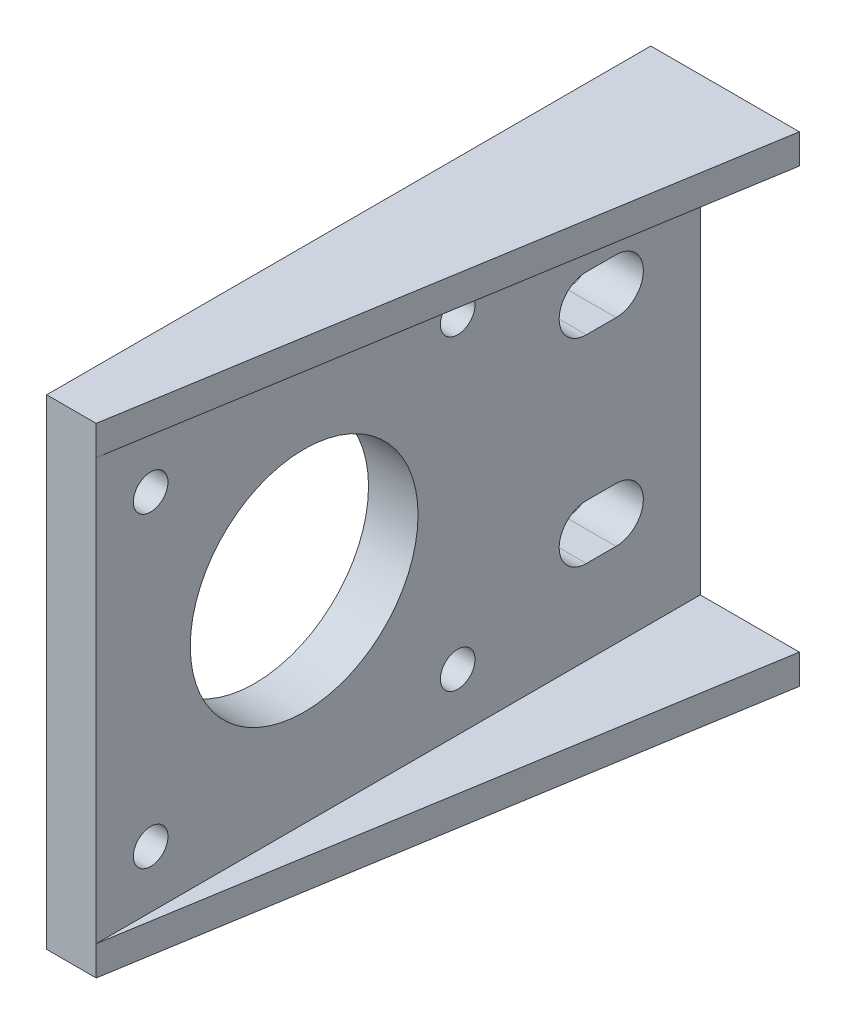
ISO-10303-21;
HEADER;
FILE_DESCRIPTION(('STEP AP214'),'2;1');
FILE_NAME('part.step','',(''),(''),'','','');
FILE_SCHEMA(('AUTOMOTIVE_DESIGN { 1 0 10303 214 1 1 1 1 }'));
ENDSEC;
DATA;
#1=APPLICATION_CONTEXT('core data for automotive mechanical design processes');
#2=APPLICATION_PROTOCOL_DEFINITION('international standard','automotive_design',2000,#1);
#3=PRODUCT_CONTEXT('',#1,'mechanical');
#4=PRODUCT('Part','Part','',(#3));
#5=PRODUCT_RELATED_PRODUCT_CATEGORY('part','',(#4));
#6=PRODUCT_DEFINITION_FORMATION('','',#4);
#7=PRODUCT_DEFINITION_CONTEXT('part definition',#1,'design');
#8=PRODUCT_DEFINITION('design','',#6,#7);
#9=PRODUCT_DEFINITION_SHAPE('','',#8);
#10=(LENGTH_UNIT() NAMED_UNIT(*) SI_UNIT(.MILLI.,.METRE.));
#11=(NAMED_UNIT(*) PLANE_ANGLE_UNIT() SI_UNIT($,.RADIAN.));
#12=(NAMED_UNIT(*) SI_UNIT($,.STERADIAN.) SOLID_ANGLE_UNIT());
#13=UNCERTAINTY_MEASURE_WITH_UNIT(LENGTH_MEASURE(1.E-05),#10,'distance_accuracy_value','');
#14=(GEOMETRIC_REPRESENTATION_CONTEXT(3) GLOBAL_UNCERTAINTY_ASSIGNED_CONTEXT((#13)) GLOBAL_UNIT_ASSIGNED_CONTEXT((#10,
#11,#12)) REPRESENTATION_CONTEXT('',''));
#15=CARTESIAN_POINT('',(0.,0.,0.));
#16=DIRECTION('',(0.,0.,1.));
#17=DIRECTION('',(1.,0.,0.));
#18=AXIS2_PLACEMENT_3D('',#15,#16,#17);
#19=CARTESIAN_POINT('',(5.,0.,0.));
#20=DIRECTION('',(-1.,0.,0.));
#21=DIRECTION('',(0.,0.,1.));
#22=AXIS2_PLACEMENT_3D('',#19,#20,#21);
#23=PLANE('',#22);
#24=CARTESIAN_POINT('',(5.,10.,-28.5));
#25=DIRECTION('',(1.,0.,0.));
#26=DIRECTION('',(0.,0.,-1.));
#27=AXIS2_PLACEMENT_3D('',#24,#25,#26);
#28=CIRCLE('',#27,2.75);
#29=CARTESIAN_POINT('',(5.,12.75,-28.5));
#30=VERTEX_POINT('',#29);
#31=CARTESIAN_POINT('',(5.,7.25,-28.5));
#32=VERTEX_POINT('',#31);
#33=EDGE_CURVE('E225',#30,#32,#28,.T.);
#34=ORIENTED_EDGE('',*,*,#33,.F.);
#35=DIRECTION('',(0.,0.,1.));
#36=VECTOR('',#35,1.);
#37=CARTESIAN_POINT('',(5.,12.75,-28.5));
#38=LINE('',#37,#36);
#39=CARTESIAN_POINT('',(5.,12.75,-31.5));
#40=VERTEX_POINT('',#39);
#41=EDGE_CURVE('E233',#40,#30,#38,.T.);
#42=ORIENTED_EDGE('',*,*,#41,.F.);
#43=CARTESIAN_POINT('',(5.,10.,-31.5));
#44=DIRECTION('',(1.,0.,0.));
#45=DIRECTION('',(0.,0.,-1.));
#46=AXIS2_PLACEMENT_3D('',#43,#44,#45);
#47=CIRCLE('',#46,2.75);
#48=CARTESIAN_POINT('',(5.,7.25,-31.5));
#49=VERTEX_POINT('',#48);
#50=EDGE_CURVE('E230',#49,#40,#47,.T.);
#51=ORIENTED_EDGE('',*,*,#50,.F.);
#52=DIRECTION('',(0.,0.,-1.));
#53=VECTOR('',#52,1.);
#54=CARTESIAN_POINT('',(5.,7.25,-28.5));
#55=LINE('',#54,#53);
#56=EDGE_CURVE('E227',#32,#49,#55,.T.);
#57=ORIENTED_EDGE('',*,*,#56,.F.);
#58=EDGE_LOOP('',(#34,#42,#51,#57));
#59=FACE_BOUND('',#58,.T.);
#60=DIRECTION('',(0.,1.,0.));
#61=VECTOR('',#60,1.);
#62=CARTESIAN_POINT('',(5.,-21.25,-40.));
#63=LINE('',#62,#61);
#64=CARTESIAN_POINT('',(5.,-21.25,-40.));
#65=VERTEX_POINT('',#64);
#66=CARTESIAN_POINT('',(5.,21.25,-40.));
#67=VERTEX_POINT('',#66);
#68=EDGE_CURVE('E286',#65,#67,#63,.T.);
#69=ORIENTED_EDGE('',*,*,#68,.T.);
#70=DIRECTION('',(0.,0.,1.));
#71=VECTOR('',#70,1.);
#72=CARTESIAN_POINT('',(5.,21.25,21.));
#73=LINE('',#72,#71);
#74=CARTESIAN_POINT('',(5.,21.25,21.));
#75=VERTEX_POINT('',#74);
#76=EDGE_CURVE('E151',#67,#75,#73,.T.);
#77=ORIENTED_EDGE('',*,*,#76,.T.);
#78=DIRECTION('',(0.,-1.,0.));
#79=VECTOR('',#78,1.);
#80=CARTESIAN_POINT('',(5.,-21.25,21.));
#81=LINE('',#80,#79);
#82=CARTESIAN_POINT('',(5.,-21.25,21.));
#83=VERTEX_POINT('',#82);
#84=EDGE_CURVE('E43',#75,#83,#81,.T.);
#85=ORIENTED_EDGE('',*,*,#84,.T.);
#86=DIRECTION('',(0.,0.,-1.));
#87=VECTOR('',#86,1.);
#88=CARTESIAN_POINT('',(5.,-21.25,21.));
#89=LINE('',#88,#87);
#90=EDGE_CURVE('E11',#83,#65,#89,.T.);
#91=ORIENTED_EDGE('',*,*,#90,.T.);
#92=EDGE_LOOP('',(#69,#77,#85,#91));
#93=FACE_BOUND('',#92,.T.);
#94=CARTESIAN_POINT('',(5.,0.,0.));
#95=DIRECTION('',(1.,0.,0.));
#96=DIRECTION('',(0.,0.,-1.));
#97=AXIS2_PLACEMENT_3D('',#94,#95,#96);
#98=CIRCLE('',#97,11.5);
#99=CARTESIAN_POINT('',(5.,0.,-11.5));
#100=VERTEX_POINT('',#99);
#101=EDGE_CURVE('E280',#100,#100,#98,.T.);
#102=ORIENTED_EDGE('',*,*,#101,.F.);
#103=EDGE_LOOP('',(#102));
#104=FACE_BOUND('',#103,.T.);
#105=CARTESIAN_POINT('',(5.,15.5,15.5));
#106=DIRECTION('',(1.,0.,0.));
#107=DIRECTION('',(0.,0.,-1.));
#108=AXIS2_PLACEMENT_3D('',#105,#106,#107);
#109=CIRCLE('',#108,1.75);
#110=CARTESIAN_POINT('',(5.,15.5,13.75));
#111=VERTEX_POINT('',#110);
#112=EDGE_CURVE('E274',#111,#111,#109,.T.);
#113=ORIENTED_EDGE('',*,*,#112,.F.);
#114=EDGE_LOOP('',(#113));
#115=FACE_BOUND('',#114,.T.);
#116=CARTESIAN_POINT('',(5.,-15.5,-15.5));
#117=DIRECTION('',(1.,0.,0.));
#118=DIRECTION('',(0.,0.,-1.));
#119=AXIS2_PLACEMENT_3D('',#116,#117,#118);
#120=CIRCLE('',#119,1.75);
#121=CARTESIAN_POINT('',(5.,-15.5,-17.25));
#122=VERTEX_POINT('',#121);
#123=EDGE_CURVE('E268',#122,#122,#120,.T.);
#124=ORIENTED_EDGE('',*,*,#123,.F.);
#125=EDGE_LOOP('',(#124));
#126=FACE_BOUND('',#125,.T.);
#127=CARTESIAN_POINT('',(5.,15.5,-15.5));
#128=DIRECTION('',(1.,0.,0.));
#129=DIRECTION('',(0.,0.,1.));
#130=AXIS2_PLACEMENT_3D('',#127,#128,#129);
#131=CIRCLE('',#130,1.74999999999999);
#132=CARTESIAN_POINT('',(5.,15.5,-13.75));
#133=VERTEX_POINT('',#132);
#134=EDGE_CURVE('E262',#133,#133,#131,.T.);
#135=ORIENTED_EDGE('',*,*,#134,.F.);
#136=EDGE_LOOP('',(#135));
#137=FACE_BOUND('',#136,.T.);
#138=CARTESIAN_POINT('',(5.,-15.5,15.5));
#139=DIRECTION('',(1.,0.,0.));
#140=DIRECTION('',(0.,0.,1.));
#141=AXIS2_PLACEMENT_3D('',#138,#139,#140);
#142=CIRCLE('',#141,1.75);
#143=CARTESIAN_POINT('',(5.,-15.5,17.25));
#144=VERTEX_POINT('',#143);
#145=EDGE_CURVE('E256',#144,#144,#142,.T.);
#146=ORIENTED_EDGE('',*,*,#145,.F.);
#147=EDGE_LOOP('',(#146));
#148=FACE_BOUND('',#147,.T.);
#149=CARTESIAN_POINT('',(5.,-9.99999999999999,-28.5));
#150=DIRECTION('',(1.,0.,0.));
#151=DIRECTION('',(0.,0.,1.));
#152=AXIS2_PLACEMENT_3D('',#149,#150,#151);
#153=CIRCLE('',#152,2.75);
#154=CARTESIAN_POINT('',(5.,-7.25,-28.5));
#155=VERTEX_POINT('',#154);
#156=CARTESIAN_POINT('',(5.,-12.75,-28.5));
#157=VERTEX_POINT('',#156);
#158=EDGE_CURVE('E199',#155,#157,#153,.T.);
#159=ORIENTED_EDGE('',*,*,#158,.F.);
#160=DIRECTION('',(0.,0.,1.));
#161=VECTOR('',#160,1.);
#162=CARTESIAN_POINT('',(5.,-7.25,-28.5));
#163=LINE('',#162,#161);
#164=CARTESIAN_POINT('',(5.,-7.25,-31.5));
#165=VERTEX_POINT('',#164);
#166=EDGE_CURVE('E206',#165,#155,#163,.T.);
#167=ORIENTED_EDGE('',*,*,#166,.F.);
#168=CARTESIAN_POINT('',(5.,-9.99999999999999,-31.5));
#169=DIRECTION('',(1.,0.,0.));
#170=DIRECTION('',(0.,0.,1.));
#171=AXIS2_PLACEMENT_3D('',#168,#169,#170);
#172=CIRCLE('',#171,2.75);
#173=CARTESIAN_POINT('',(5.,-12.75,-31.5));
#174=VERTEX_POINT('',#173);
#175=EDGE_CURVE('E204',#174,#165,#172,.T.);
#176=ORIENTED_EDGE('',*,*,#175,.F.);
#177=DIRECTION('',(0.,0.,-1.));
#178=VECTOR('',#177,1.);
#179=CARTESIAN_POINT('',(5.,-12.75,-28.5));
#180=LINE('',#179,#178);
#181=EDGE_CURVE('E201',#157,#174,#180,.T.);
#182=ORIENTED_EDGE('',*,*,#181,.F.);
#183=EDGE_LOOP('',(#159,#167,#176,#182));
#184=FACE_BOUND('',#183,.T.);
#185=ADVANCED_FACE('F34',(#59,#93,#104,#115,#126,#137,#148,#184),#23,.F.);
#186=CARTESIAN_POINT('',(0.,0.,0.));
#187=DIRECTION('',(-1.,0.,0.));
#188=DIRECTION('',(0.,0.,1.));
#189=AXIS2_PLACEMENT_3D('',#186,#187,#188);
#190=PLANE('',#189);
#191=CARTESIAN_POINT('',(0.,15.5,-15.5));
#192=DIRECTION('',(1.,0.,0.));
#193=DIRECTION('',(0.,0.,1.));
#194=AXIS2_PLACEMENT_3D('',#191,#192,#193);
#195=CIRCLE('',#194,1.74999999999999);
#196=CARTESIAN_POINT('',(0.,15.5,-13.75));
#197=VERTEX_POINT('',#196);
#198=EDGE_CURVE('E259',#197,#197,#195,.T.);
#199=ORIENTED_EDGE('',*,*,#198,.T.);
#200=EDGE_LOOP('',(#199));
#201=FACE_BOUND('',#200,.T.);
#202=CARTESIAN_POINT('',(0.,15.5,15.5));
#203=DIRECTION('',(1.,0.,0.));
#204=DIRECTION('',(0.,0.,-1.));
#205=AXIS2_PLACEMENT_3D('',#202,#203,#204);
#206=CIRCLE('',#205,1.75);
#207=CARTESIAN_POINT('',(0.,15.5,13.75));
#208=VERTEX_POINT('',#207);
#209=EDGE_CURVE('E271',#208,#208,#206,.T.);
#210=ORIENTED_EDGE('',*,*,#209,.T.);
#211=EDGE_LOOP('',(#210));
#212=FACE_BOUND('',#211,.T.);
#213=DIRECTION('',(0.,1.,0.));
#214=VECTOR('',#213,1.);
#215=CARTESIAN_POINT('',(0.,-21.25,-40.));
#216=LINE('',#215,#214);
#217=CARTESIAN_POINT('',(0.,-24.25,-40.));
#218=VERTEX_POINT('',#217);
#219=CARTESIAN_POINT('',(0.,24.25,-40.));
#220=VERTEX_POINT('',#219);
#221=EDGE_CURVE('E283',#218,#220,#216,.T.);
#222=ORIENTED_EDGE('',*,*,#221,.F.);
#223=DIRECTION('',(0.,0.,-1.));
#224=VECTOR('',#223,1.);
#225=CARTESIAN_POINT('',(0.,-24.25,21.));
#226=LINE('',#225,#224);
#227=CARTESIAN_POINT('',(0.,-24.25,21.));
#228=VERTEX_POINT('',#227);
#229=EDGE_CURVE('E179',#228,#218,#226,.T.);
#230=ORIENTED_EDGE('',*,*,#229,.F.);
#231=DIRECTION('',(0.,-1.,0.));
#232=VECTOR('',#231,1.);
#233=CARTESIAN_POINT('',(0.,-21.25,21.));
#234=LINE('',#233,#232);
#235=CARTESIAN_POINT('',(0.,24.25,21.));
#236=VERTEX_POINT('',#235);
#237=EDGE_CURVE('E38',#236,#228,#234,.T.);
#238=ORIENTED_EDGE('',*,*,#237,.F.);
#239=DIRECTION('',(0.,0.,-1.));
#240=VECTOR('',#239,1.);
#241=CARTESIAN_POINT('',(0.,24.25,21.));
#242=LINE('',#241,#240);
#243=EDGE_CURVE('E171',#236,#220,#242,.T.);
#244=ORIENTED_EDGE('',*,*,#243,.T.);
#245=EDGE_LOOP('',(#222,#230,#238,#244));
#246=FACE_BOUND('',#245,.T.);
#247=CARTESIAN_POINT('',(0.,0.,0.));
#248=DIRECTION('',(1.,0.,0.));
#249=DIRECTION('',(0.,0.,-1.));
#250=AXIS2_PLACEMENT_3D('',#247,#248,#249);
#251=CIRCLE('',#250,11.5);
#252=CARTESIAN_POINT('',(0.,0.,-11.5));
#253=VERTEX_POINT('',#252);
#254=EDGE_CURVE('E277',#253,#253,#251,.T.);
#255=ORIENTED_EDGE('',*,*,#254,.T.);
#256=EDGE_LOOP('',(#255));
#257=FACE_BOUND('',#256,.T.);
#258=CARTESIAN_POINT('',(0.,-15.5,-15.5));
#259=DIRECTION('',(1.,0.,0.));
#260=DIRECTION('',(0.,0.,-1.));
#261=AXIS2_PLACEMENT_3D('',#258,#259,#260);
#262=CIRCLE('',#261,1.75);
#263=CARTESIAN_POINT('',(0.,-15.5,-17.25));
#264=VERTEX_POINT('',#263);
#265=EDGE_CURVE('E265',#264,#264,#262,.T.);
#266=ORIENTED_EDGE('',*,*,#265,.T.);
#267=EDGE_LOOP('',(#266));
#268=FACE_BOUND('',#267,.T.);
#269=CARTESIAN_POINT('',(0.,-15.5,15.5));
#270=DIRECTION('',(1.,0.,0.));
#271=DIRECTION('',(0.,0.,1.));
#272=AXIS2_PLACEMENT_3D('',#269,#270,#271);
#273=CIRCLE('',#272,1.75);
#274=CARTESIAN_POINT('',(0.,-15.5,17.25));
#275=VERTEX_POINT('',#274);
#276=EDGE_CURVE('E255',#275,#275,#273,.T.);
#277=ORIENTED_EDGE('',*,*,#276,.T.);
#278=EDGE_LOOP('',(#277));
#279=FACE_BOUND('',#278,.T.);
#280=DIRECTION('',(0.,0.,1.));
#281=VECTOR('',#280,1.);
#282=CARTESIAN_POINT('',(0.,12.75,-28.5));
#283=LINE('',#282,#281);
#284=CARTESIAN_POINT('',(0.,12.75,-31.5));
#285=VERTEX_POINT('',#284);
#286=CARTESIAN_POINT('',(0.,12.75,-28.5));
#287=VERTEX_POINT('',#286);
#288=EDGE_CURVE('E228',#285,#287,#283,.T.);
#289=ORIENTED_EDGE('',*,*,#288,.T.);
#290=CARTESIAN_POINT('',(0.,10.,-28.5));
#291=DIRECTION('',(1.,0.,0.));
#292=DIRECTION('',(0.,0.,-1.));
#293=AXIS2_PLACEMENT_3D('',#290,#291,#292);
#294=CIRCLE('',#293,2.75);
#295=CARTESIAN_POINT('',(0.,7.25,-28.5));
#296=VERTEX_POINT('',#295);
#297=EDGE_CURVE('E224',#287,#296,#294,.T.);
#298=ORIENTED_EDGE('',*,*,#297,.T.);
#299=DIRECTION('',(0.,0.,-1.));
#300=VECTOR('',#299,1.);
#301=CARTESIAN_POINT('',(0.,7.25,-28.5));
#302=LINE('',#301,#300);
#303=CARTESIAN_POINT('',(0.,7.25,-31.5));
#304=VERTEX_POINT('',#303);
#305=EDGE_CURVE('E238',#296,#304,#302,.T.);
#306=ORIENTED_EDGE('',*,*,#305,.T.);
#307=CARTESIAN_POINT('',(0.,10.,-31.5));
#308=DIRECTION('',(1.,0.,0.));
#309=DIRECTION('',(0.,0.,-1.));
#310=AXIS2_PLACEMENT_3D('',#307,#308,#309);
#311=CIRCLE('',#310,2.75);
#312=EDGE_CURVE('E241',#304,#285,#311,.T.);
#313=ORIENTED_EDGE('',*,*,#312,.T.);
#314=EDGE_LOOP('',(#289,#298,#306,#313));
#315=FACE_BOUND('',#314,.T.);
#316=DIRECTION('',(0.,0.,1.));
#317=VECTOR('',#316,1.);
#318=CARTESIAN_POINT('',(0.,-7.25,-28.5));
#319=LINE('',#318,#317);
#320=CARTESIAN_POINT('',(0.,-7.24999999999999,-31.5));
#321=VERTEX_POINT('',#320);
#322=CARTESIAN_POINT('',(0.,-7.25,-28.5));
#323=VERTEX_POINT('',#322);
#324=EDGE_CURVE('E202',#321,#323,#319,.T.);
#325=ORIENTED_EDGE('',*,*,#324,.T.);
#326=CARTESIAN_POINT('',(0.,-9.99999999999999,-28.5));
#327=DIRECTION('',(1.,0.,0.));
#328=DIRECTION('',(0.,0.,1.));
#329=AXIS2_PLACEMENT_3D('',#326,#327,#328);
#330=CIRCLE('',#329,2.75);
#331=CARTESIAN_POINT('',(0.,-12.75,-28.5));
#332=VERTEX_POINT('',#331);
#333=EDGE_CURVE('E59',#323,#332,#330,.T.);
#334=ORIENTED_EDGE('',*,*,#333,.T.);
#335=DIRECTION('',(0.,0.,-1.));
#336=VECTOR('',#335,1.);
#337=CARTESIAN_POINT('',(0.,-12.75,-28.5));
#338=LINE('',#337,#336);
#339=CARTESIAN_POINT('',(0.,-12.75,-31.5));
#340=VERTEX_POINT('',#339);
#341=EDGE_CURVE('E210',#332,#340,#338,.T.);
#342=ORIENTED_EDGE('',*,*,#341,.T.);
#343=CARTESIAN_POINT('',(0.,-9.99999999999999,-31.5));
#344=DIRECTION('',(1.,0.,0.));
#345=DIRECTION('',(0.,0.,1.));
#346=AXIS2_PLACEMENT_3D('',#343,#344,#345);
#347=CIRCLE('',#346,2.75);
#348=EDGE_CURVE('E213',#340,#321,#347,.T.);
#349=ORIENTED_EDGE('',*,*,#348,.T.);
#350=EDGE_LOOP('',(#325,#334,#342,#349));
#351=FACE_BOUND('',#350,.T.);
#352=ADVANCED_FACE('F302',(#201,#212,#246,#257,#268,#279,#315,#351),#190,.T.);
#353=CARTESIAN_POINT('',(5.,-21.25,-40.));
#354=DIRECTION('',(0.,0.,1.));
#355=DIRECTION('',(1.,0.,0.));
#356=AXIS2_PLACEMENT_3D('',#353,#354,#355);
#357=PLANE('',#356);
#358=ORIENTED_EDGE('',*,*,#221,.T.);
#359=DIRECTION('',(1.,0.,0.));
#360=VECTOR('',#359,1.);
#361=CARTESIAN_POINT('',(0.,24.25,-40.));
#362=LINE('',#361,#360);
#363=CARTESIAN_POINT('',(15.,24.25,-40.));
#364=VERTEX_POINT('',#363);
#365=EDGE_CURVE('E160',#220,#364,#362,.T.);
#366=ORIENTED_EDGE('',*,*,#365,.T.);
#367=DIRECTION('',(0.,1.,0.));
#368=VECTOR('',#367,1.);
#369=CARTESIAN_POINT('',(15.,21.25,-40.));
#370=LINE('',#369,#368);
#371=CARTESIAN_POINT('',(15.,21.25,-40.));
#372=VERTEX_POINT('',#371);
#373=EDGE_CURVE('E158',#372,#364,#370,.T.);
#374=ORIENTED_EDGE('',*,*,#373,.F.);
#375=DIRECTION('',(1.,0.,0.));
#376=VECTOR('',#375,1.);
#377=CARTESIAN_POINT('',(0.,21.25,-40.));
#378=LINE('',#377,#376);
#379=EDGE_CURVE('E145',#67,#372,#378,.T.);
#380=ORIENTED_EDGE('',*,*,#379,.F.);
#381=ORIENTED_EDGE('',*,*,#68,.F.);
#382=DIRECTION('',(1.,0.,0.));
#383=VECTOR('',#382,1.);
#384=CARTESIAN_POINT('',(0.,-21.25,-40.));
#385=LINE('',#384,#383);
#386=CARTESIAN_POINT('',(15.,-21.25,-40.));
#387=VERTEX_POINT('',#386);
#388=EDGE_CURVE('E163',#65,#387,#385,.T.);
#389=ORIENTED_EDGE('',*,*,#388,.T.);
#390=DIRECTION('',(0.,1.,0.));
#391=VECTOR('',#390,1.);
#392=CARTESIAN_POINT('',(15.,-24.25,-40.));
#393=LINE('',#392,#391);
#394=CARTESIAN_POINT('',(15.,-24.25,-40.));
#395=VERTEX_POINT('',#394);
#396=EDGE_CURVE('E196',#395,#387,#393,.T.);
#397=ORIENTED_EDGE('',*,*,#396,.F.);
#398=DIRECTION('',(1.,0.,0.));
#399=VECTOR('',#398,1.);
#400=CARTESIAN_POINT('',(0.,-24.25,-40.));
#401=LINE('',#400,#399);
#402=EDGE_CURVE('E182',#218,#395,#401,.T.);
#403=ORIENTED_EDGE('',*,*,#402,.F.);
#404=EDGE_LOOP('',(#358,#366,#374,#380,#381,#389,#397,#403));
#405=FACE_BOUND('',#404,.T.);
#406=ADVANCED_FACE('F36',(#405),#357,.F.);
#407=CARTESIAN_POINT('',(5.,-21.25,21.));
#408=DIRECTION('',(0.,0.,-1.));
#409=DIRECTION('',(-1.,0.,0.));
#410=AXIS2_PLACEMENT_3D('',#407,#408,#409);
#411=PLANE('',#410);
#412=ORIENTED_EDGE('',*,*,#237,.T.);
#413=DIRECTION('',(-1.,0.,0.));
#414=VECTOR('',#413,1.);
#415=CARTESIAN_POINT('',(5.,-24.25,21.));
#416=LINE('',#415,#414);
#417=CARTESIAN_POINT('',(5.,-24.25,21.));
#418=VERTEX_POINT('',#417);
#419=EDGE_CURVE('E187',#418,#228,#416,.T.);
#420=ORIENTED_EDGE('',*,*,#419,.F.);
#421=DIRECTION('',(0.,1.,0.));
#422=VECTOR('',#421,1.);
#423=CARTESIAN_POINT('',(5.,-24.25,21.));
#424=LINE('',#423,#422);
#425=EDGE_CURVE('E190',#418,#83,#424,.T.);
#426=ORIENTED_EDGE('',*,*,#425,.T.);
#427=ORIENTED_EDGE('',*,*,#84,.F.);
#428=DIRECTION('',(0.,1.,0.));
#429=VECTOR('',#428,1.);
#430=CARTESIAN_POINT('',(5.,21.25,21.));
#431=LINE('',#430,#429);
#432=CARTESIAN_POINT('',(5.,24.25,21.));
#433=VERTEX_POINT('',#432);
#434=EDGE_CURVE('E164',#75,#433,#431,.T.);
#435=ORIENTED_EDGE('',*,*,#434,.T.);
#436=DIRECTION('',(-1.,0.,0.));
#437=VECTOR('',#436,1.);
#438=CARTESIAN_POINT('',(5.,24.25,21.));
#439=LINE('',#438,#437);
#440=EDGE_CURVE('E155',#433,#236,#439,.T.);
#441=ORIENTED_EDGE('',*,*,#440,.T.);
#442=EDGE_LOOP('',(#412,#420,#426,#427,#435,#441));
#443=FACE_BOUND('',#442,.T.);
#444=ADVANCED_FACE('F293',(#443),#411,.F.);
#445=CARTESIAN_POINT('',(5.,0.,0.));
#446=DIRECTION('',(-1.,0.,0.));
#447=DIRECTION('',(0.,0.,1.));
#448=AXIS2_PLACEMENT_3D('',#445,#446,#447);
#449=CYLINDRICAL_SURFACE('',#448,11.5);
#450=ORIENTED_EDGE('',*,*,#101,.T.);
#451=EDGE_LOOP('',(#450));
#452=FACE_BOUND('',#451,.T.);
#453=ORIENTED_EDGE('',*,*,#254,.F.);
#454=EDGE_LOOP('',(#453));
#455=FACE_BOUND('',#454,.T.);
#456=ADVANCED_FACE('F332',(#452,#455),#449,.F.);
#457=CARTESIAN_POINT('',(5.,15.5,15.5));
#458=DIRECTION('',(-1.,0.,0.));
#459=DIRECTION('',(0.,0.,1.));
#460=AXIS2_PLACEMENT_3D('',#457,#458,#459);
#461=CYLINDRICAL_SURFACE('',#460,1.75);
#462=ORIENTED_EDGE('',*,*,#112,.T.);
#463=EDGE_LOOP('',(#462));
#464=FACE_BOUND('',#463,.T.);
#465=ORIENTED_EDGE('',*,*,#209,.F.);
#466=EDGE_LOOP('',(#465));
#467=FACE_BOUND('',#466,.T.);
#468=ADVANCED_FACE('F339',(#464,#467),#461,.F.);
#469=CARTESIAN_POINT('',(5.,-15.5,-15.5));
#470=DIRECTION('',(-1.,0.,0.));
#471=DIRECTION('',(0.,0.,1.));
#472=AXIS2_PLACEMENT_3D('',#469,#470,#471);
#473=CYLINDRICAL_SURFACE('',#472,1.75);
#474=ORIENTED_EDGE('',*,*,#123,.T.);
#475=EDGE_LOOP('',(#474));
#476=FACE_BOUND('',#475,.T.);
#477=ORIENTED_EDGE('',*,*,#265,.F.);
#478=EDGE_LOOP('',(#477));
#479=FACE_BOUND('',#478,.T.);
#480=ADVANCED_FACE('F469',(#476,#479),#473,.F.);
#481=CARTESIAN_POINT('',(5.,15.5,-15.5));
#482=DIRECTION('',(-1.,0.,0.));
#483=DIRECTION('',(0.,0.,1.));
#484=AXIS2_PLACEMENT_3D('',#481,#482,#483);
#485=CYLINDRICAL_SURFACE('',#484,1.74999999999999);
#486=ORIENTED_EDGE('',*,*,#134,.T.);
#487=EDGE_LOOP('',(#486));
#488=FACE_BOUND('',#487,.T.);
#489=ORIENTED_EDGE('',*,*,#198,.F.);
#490=EDGE_LOOP('',(#489));
#491=FACE_BOUND('',#490,.T.);
#492=ADVANCED_FACE('F459',(#488,#491),#485,.F.);
#493=CARTESIAN_POINT('',(5.,-15.5,15.5));
#494=DIRECTION('',(-1.,0.,0.));
#495=DIRECTION('',(0.,0.,1.));
#496=AXIS2_PLACEMENT_3D('',#493,#494,#495);
#497=CYLINDRICAL_SURFACE('',#496,1.75);
#498=ORIENTED_EDGE('',*,*,#145,.T.);
#499=EDGE_LOOP('',(#498));
#500=FACE_BOUND('',#499,.T.);
#501=ORIENTED_EDGE('',*,*,#276,.F.);
#502=EDGE_LOOP('',(#501));
#503=FACE_BOUND('',#502,.T.);
#504=ADVANCED_FACE('F449',(#500,#503),#497,.F.);
#505=CARTESIAN_POINT('',(5.,10.,-28.5));
#506=DIRECTION('',(-1.,0.,0.));
#507=DIRECTION('',(0.,0.,1.));
#508=AXIS2_PLACEMENT_3D('',#505,#506,#507);
#509=CYLINDRICAL_SURFACE('',#508,2.75);
#510=ORIENTED_EDGE('',*,*,#297,.F.);
#511=DIRECTION('',(-1.,0.,0.));
#512=VECTOR('',#511,1.);
#513=CARTESIAN_POINT('',(5.,12.75,-28.5));
#514=LINE('',#513,#512);
#515=EDGE_CURVE('E235',#30,#287,#514,.T.);
#516=ORIENTED_EDGE('',*,*,#515,.F.);
#517=ORIENTED_EDGE('',*,*,#33,.T.);
#518=DIRECTION('',(-1.,0.,0.));
#519=VECTOR('',#518,1.);
#520=CARTESIAN_POINT('',(5.,7.25,-28.5));
#521=LINE('',#520,#519);
#522=EDGE_CURVE('E252',#32,#296,#521,.T.);
#523=ORIENTED_EDGE('',*,*,#522,.T.);
#524=EDGE_LOOP('',(#510,#516,#517,#523));
#525=FACE_BOUND('',#524,.T.);
#526=ADVANCED_FACE('F439',(#525),#509,.F.);
#527=CARTESIAN_POINT('',(5.,7.25,-28.5));
#528=DIRECTION('',(0.,1.,0.));
#529=DIRECTION('',(0.,0.,1.));
#530=AXIS2_PLACEMENT_3D('',#527,#528,#529);
#531=PLANE('',#530);
#532=ORIENTED_EDGE('',*,*,#305,.F.);
#533=ORIENTED_EDGE('',*,*,#522,.F.);
#534=ORIENTED_EDGE('',*,*,#56,.T.);
#535=DIRECTION('',(-1.,0.,0.));
#536=VECTOR('',#535,1.);
#537=CARTESIAN_POINT('',(5.,7.25,-31.5));
#538=LINE('',#537,#536);
#539=EDGE_CURVE('E250',#49,#304,#538,.T.);
#540=ORIENTED_EDGE('',*,*,#539,.T.);
#541=EDGE_LOOP('',(#532,#533,#534,#540));
#542=FACE_BOUND('',#541,.T.);
#543=ADVANCED_FACE('F429',(#542),#531,.T.);
#544=CARTESIAN_POINT('',(5.,10.,-31.5));
#545=DIRECTION('',(-1.,0.,0.));
#546=DIRECTION('',(0.,0.,1.));
#547=AXIS2_PLACEMENT_3D('',#544,#545,#546);
#548=CYLINDRICAL_SURFACE('',#547,2.75);
#549=ORIENTED_EDGE('',*,*,#312,.F.);
#550=ORIENTED_EDGE('',*,*,#539,.F.);
#551=ORIENTED_EDGE('',*,*,#50,.T.);
#552=DIRECTION('',(-1.,0.,0.));
#553=VECTOR('',#552,1.);
#554=CARTESIAN_POINT('',(5.,12.75,-31.5));
#555=LINE('',#554,#553);
#556=EDGE_CURVE('E248',#40,#285,#555,.T.);
#557=ORIENTED_EDGE('',*,*,#556,.T.);
#558=EDGE_LOOP('',(#549,#550,#551,#557));
#559=FACE_BOUND('',#558,.T.);
#560=ADVANCED_FACE('F419',(#559),#548,.F.);
#561=CARTESIAN_POINT('',(5.,12.75,-28.5));
#562=DIRECTION('',(0.,-1.,0.));
#563=DIRECTION('',(0.,0.,-1.));
#564=AXIS2_PLACEMENT_3D('',#561,#562,#563);
#565=PLANE('',#564);
#566=ORIENTED_EDGE('',*,*,#288,.F.);
#567=ORIENTED_EDGE('',*,*,#556,.F.);
#568=ORIENTED_EDGE('',*,*,#41,.T.);
#569=ORIENTED_EDGE('',*,*,#515,.T.);
#570=EDGE_LOOP('',(#566,#567,#568,#569));
#571=FACE_BOUND('',#570,.T.);
#572=ADVANCED_FACE('F410',(#571),#565,.T.);
#573=CARTESIAN_POINT('',(5.,-9.99999999999999,-28.5));
#574=DIRECTION('',(-1.,0.,0.));
#575=DIRECTION('',(0.,0.,1.));
#576=AXIS2_PLACEMENT_3D('',#573,#574,#575);
#577=CYLINDRICAL_SURFACE('',#576,2.75);
#578=ORIENTED_EDGE('',*,*,#333,.F.);
#579=DIRECTION('',(-1.,0.,0.));
#580=VECTOR('',#579,1.);
#581=CARTESIAN_POINT('',(5.,-7.25,-28.5));
#582=LINE('',#581,#580);
#583=EDGE_CURVE('E208',#155,#323,#582,.T.);
#584=ORIENTED_EDGE('',*,*,#583,.F.);
#585=ORIENTED_EDGE('',*,*,#158,.T.);
#586=DIRECTION('',(-1.,0.,0.));
#587=VECTOR('',#586,1.);
#588=CARTESIAN_POINT('',(5.,-12.75,-28.5));
#589=LINE('',#588,#587);
#590=EDGE_CURVE('E222',#157,#332,#589,.T.);
#591=ORIENTED_EDGE('',*,*,#590,.T.);
#592=EDGE_LOOP('',(#578,#584,#585,#591));
#593=FACE_BOUND('',#592,.T.);
#594=ADVANCED_FACE('F400',(#593),#577,.F.);
#595=CARTESIAN_POINT('',(5.,-12.75,-28.5));
#596=DIRECTION('',(0.,1.,0.));
#597=DIRECTION('',(0.,0.,1.));
#598=AXIS2_PLACEMENT_3D('',#595,#596,#597);
#599=PLANE('',#598);
#600=ORIENTED_EDGE('',*,*,#341,.F.);
#601=ORIENTED_EDGE('',*,*,#590,.F.);
#602=ORIENTED_EDGE('',*,*,#181,.T.);
#603=DIRECTION('',(-1.,0.,0.));
#604=VECTOR('',#603,1.);
#605=CARTESIAN_POINT('',(5.,-12.75,-31.5));
#606=LINE('',#605,#604);
#607=EDGE_CURVE('E220',#174,#340,#606,.T.);
#608=ORIENTED_EDGE('',*,*,#607,.T.);
#609=EDGE_LOOP('',(#600,#601,#602,#608));
#610=FACE_BOUND('',#609,.T.);
#611=ADVANCED_FACE('F390',(#610),#599,.T.);
#612=CARTESIAN_POINT('',(5.,-9.99999999999999,-31.5));
#613=DIRECTION('',(-1.,0.,0.));
#614=DIRECTION('',(0.,0.,1.));
#615=AXIS2_PLACEMENT_3D('',#612,#613,#614);
#616=CYLINDRICAL_SURFACE('',#615,2.75);
#617=ORIENTED_EDGE('',*,*,#348,.F.);
#618=ORIENTED_EDGE('',*,*,#607,.F.);
#619=ORIENTED_EDGE('',*,*,#175,.T.);
#620=DIRECTION('',(-1.,0.,0.));
#621=VECTOR('',#620,1.);
#622=CARTESIAN_POINT('',(5.,-7.24999999999999,-31.5));
#623=LINE('',#622,#621);
#624=EDGE_CURVE('E51',#165,#321,#623,.T.);
#625=ORIENTED_EDGE('',*,*,#624,.T.);
#626=EDGE_LOOP('',(#617,#618,#619,#625));
#627=FACE_BOUND('',#626,.T.);
#628=ADVANCED_FACE('F381',(#627),#616,.F.);
#629=CARTESIAN_POINT('',(5.,-7.25,-28.5));
#630=DIRECTION('',(0.,-1.,0.));
#631=DIRECTION('',(0.,0.,-1.));
#632=AXIS2_PLACEMENT_3D('',#629,#630,#631);
#633=PLANE('',#632);
#634=ORIENTED_EDGE('',*,*,#324,.F.);
#635=ORIENTED_EDGE('',*,*,#624,.F.);
#636=ORIENTED_EDGE('',*,*,#166,.T.);
#637=ORIENTED_EDGE('',*,*,#583,.T.);
#638=EDGE_LOOP('',(#634,#635,#636,#637));
#639=FACE_BOUND('',#638,.T.);
#640=ADVANCED_FACE('F372',(#639),#633,.T.);
#641=CARTESIAN_POINT('',(15.,-24.25,-40.));
#642=DIRECTION('',(-0.986827665105534,0.,-0.161775027066481));
#643=DIRECTION('',(-0.161775027066481,0.,0.986827665105534));
#644=AXIS2_PLACEMENT_3D('',#641,#642,#643);
#645=PLANE('',#644);
#646=DIRECTION('',(-0.161775027066481,0.,0.986827665105534));
#647=VECTOR('',#646,1.);
#648=CARTESIAN_POINT('',(15.,-21.25,-40.));
#649=LINE('',#648,#647);
#650=EDGE_CURVE('E183',#387,#83,#649,.T.);
#651=ORIENTED_EDGE('',*,*,#650,.T.);
#652=ORIENTED_EDGE('',*,*,#425,.F.);
#653=DIRECTION('',(-0.161775027066481,0.,0.986827665105534));
#654=VECTOR('',#653,1.);
#655=CARTESIAN_POINT('',(15.,-24.25,-40.));
#656=LINE('',#655,#654);
#657=EDGE_CURVE('E185',#395,#418,#656,.T.);
#658=ORIENTED_EDGE('',*,*,#657,.F.);
#659=ORIENTED_EDGE('',*,*,#396,.T.);
#660=EDGE_LOOP('',(#651,#652,#658,#659));
#661=FACE_BOUND('',#660,.T.);
#662=ADVANCED_FACE('F307',(#661),#645,.F.);
#663=CARTESIAN_POINT('',(0.,-24.25,0.));
#664=DIRECTION('',(0.,-1.,0.));
#665=DIRECTION('',(0.,0.,-1.));
#666=AXIS2_PLACEMENT_3D('',#663,#664,#665);
#667=PLANE('',#666);
#668=ORIENTED_EDGE('',*,*,#229,.T.);
#669=ORIENTED_EDGE('',*,*,#402,.T.);
#670=ORIENTED_EDGE('',*,*,#657,.T.);
#671=ORIENTED_EDGE('',*,*,#419,.T.);
#672=EDGE_LOOP('',(#668,#669,#670,#671));
#673=FACE_BOUND('',#672,.T.);
#674=ADVANCED_FACE('F299',(#673),#667,.T.);
#675=CARTESIAN_POINT('',(0.,-21.25,0.));
#676=DIRECTION('',(0.,-1.,0.));
#677=DIRECTION('',(0.,0.,-1.));
#678=AXIS2_PLACEMENT_3D('',#675,#676,#677);
#679=PLANE('',#678);
#680=ORIENTED_EDGE('',*,*,#90,.F.);
#681=ORIENTED_EDGE('',*,*,#650,.F.);
#682=ORIENTED_EDGE('',*,*,#388,.F.);
#683=EDGE_LOOP('',(#680,#681,#682));
#684=FACE_BOUND('',#683,.T.);
#685=ADVANCED_FACE('F312',(#684),#679,.F.);
#686=CARTESIAN_POINT('',(0.,21.25,0.));
#687=DIRECTION('',(0.,-1.,0.));
#688=DIRECTION('',(0.,0.,-1.));
#689=AXIS2_PLACEMENT_3D('',#686,#687,#688);
#690=PLANE('',#689);
#691=ORIENTED_EDGE('',*,*,#76,.F.);
#692=ORIENTED_EDGE('',*,*,#379,.T.);
#693=DIRECTION('',(-0.161775027066481,0.,0.986827665105534));
#694=VECTOR('',#693,1.);
#695=CARTESIAN_POINT('',(15.,21.25,-40.));
#696=LINE('',#695,#694);
#697=EDGE_CURVE('E149',#372,#75,#696,.T.);
#698=ORIENTED_EDGE('',*,*,#697,.T.);
#699=EDGE_LOOP('',(#691,#692,#698));
#700=FACE_BOUND('',#699,.T.);
#701=ADVANCED_FACE('F147',(#700),#690,.T.);
#702=CARTESIAN_POINT('',(15.,21.25,-40.));
#703=DIRECTION('',(-0.986827665105534,0.,-0.161775027066481));
#704=DIRECTION('',(-0.161775027066481,0.,0.986827665105534));
#705=AXIS2_PLACEMENT_3D('',#702,#703,#704);
#706=PLANE('',#705);
#707=DIRECTION('',(-0.161775027066481,0.,0.986827665105534));
#708=VECTOR('',#707,1.);
#709=CARTESIAN_POINT('',(15.,24.25,-40.));
#710=LINE('',#709,#708);
#711=EDGE_CURVE('E175',#364,#433,#710,.T.);
#712=ORIENTED_EDGE('',*,*,#711,.T.);
#713=ORIENTED_EDGE('',*,*,#434,.F.);
#714=ORIENTED_EDGE('',*,*,#697,.F.);
#715=ORIENTED_EDGE('',*,*,#373,.T.);
#716=EDGE_LOOP('',(#712,#713,#714,#715));
#717=FACE_BOUND('',#716,.T.);
#718=ADVANCED_FACE('F166',(#717),#706,.F.);
#719=CARTESIAN_POINT('',(0.,24.25,0.));
#720=DIRECTION('',(0.,-1.,0.));
#721=DIRECTION('',(0.,0.,-1.));
#722=AXIS2_PLACEMENT_3D('',#719,#720,#721);
#723=PLANE('',#722);
#724=ORIENTED_EDGE('',*,*,#243,.F.);
#725=ORIENTED_EDGE('',*,*,#440,.F.);
#726=ORIENTED_EDGE('',*,*,#711,.F.);
#727=ORIENTED_EDGE('',*,*,#365,.F.);
#728=EDGE_LOOP('',(#724,#725,#726,#727));
#729=FACE_BOUND('',#728,.T.);
#730=ADVANCED_FACE('F530',(#729),#723,.F.);
#731=CLOSED_SHELL('',(#185,#352,#406,#444,#456,#468,#480,#492,#504,#526,#543,#560,#572,#594,
#611,#628,#640,#662,#674,#685,#701,#718,#730));
#732=MANIFOLD_SOLID_BREP('B2',#731);
#733=ADVANCED_BREP_SHAPE_REPRESENTATION('',(#18,#732),#14);
#734=SHAPE_DEFINITION_REPRESENTATION(#9,#733);
ENDSEC;
END-ISO-10303-21;
